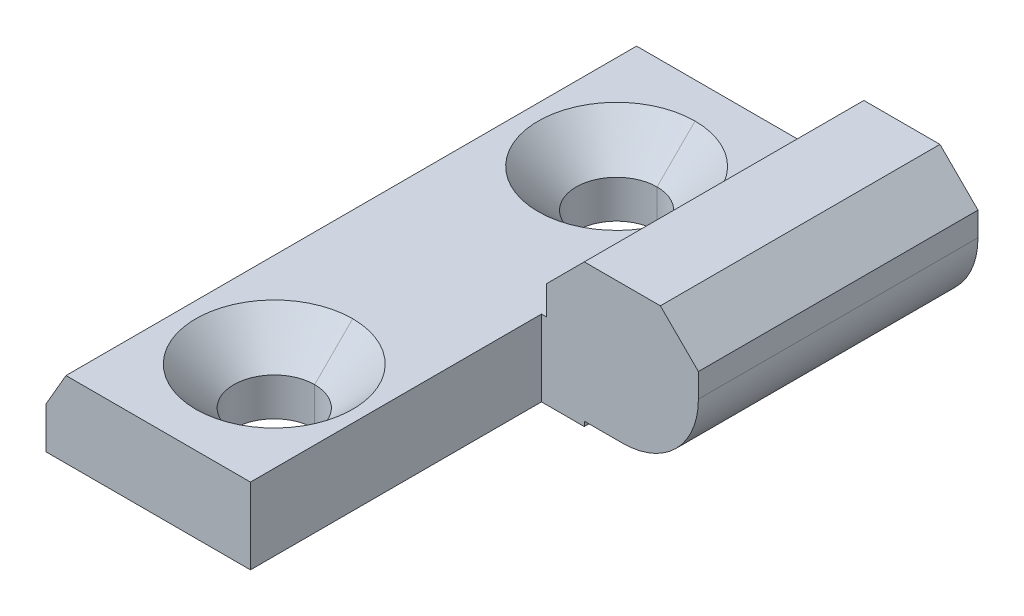
ISO-10303-21;
HEADER;
FILE_DESCRIPTION(('STEP AP214'),'2;1');
FILE_NAME('part.step','',(''),(''),'','','');
FILE_SCHEMA(('AUTOMOTIVE_DESIGN { 1 0 10303 214 1 1 1 1 }'));
ENDSEC;
DATA;
#1=APPLICATION_CONTEXT('core data for automotive mechanical design processes');
#2=APPLICATION_PROTOCOL_DEFINITION('international standard','automotive_design',2000,#1);
#3=PRODUCT_CONTEXT('',#1,'mechanical');
#4=PRODUCT('Part','Part','',(#3));
#5=PRODUCT_RELATED_PRODUCT_CATEGORY('part','',(#4));
#6=PRODUCT_DEFINITION_FORMATION('','',#4);
#7=PRODUCT_DEFINITION_CONTEXT('part definition',#1,'design');
#8=PRODUCT_DEFINITION('design','',#6,#7);
#9=PRODUCT_DEFINITION_SHAPE('','',#8);
#10=(LENGTH_UNIT() NAMED_UNIT(*) SI_UNIT(.MILLI.,.METRE.));
#11=(NAMED_UNIT(*) PLANE_ANGLE_UNIT() SI_UNIT($,.RADIAN.));
#12=(NAMED_UNIT(*) SI_UNIT($,.STERADIAN.) SOLID_ANGLE_UNIT());
#13=UNCERTAINTY_MEASURE_WITH_UNIT(LENGTH_MEASURE(1.E-05),#10,'distance_accuracy_value','');
#14=(GEOMETRIC_REPRESENTATION_CONTEXT(3) GLOBAL_UNCERTAINTY_ASSIGNED_CONTEXT((#13)) GLOBAL_UNIT_ASSIGNED_CONTEXT((#10,
#11,#12)) REPRESENTATION_CONTEXT('',''));
#15=CARTESIAN_POINT('',(0.,0.,0.));
#16=DIRECTION('',(0.,0.,1.));
#17=DIRECTION('',(1.,0.,0.));
#18=AXIS2_PLACEMENT_3D('',#15,#16,#17);
#19=CARTESIAN_POINT('',(0.,0.,60.));
#20=DIRECTION('',(0.,1.,0.));
#21=DIRECTION('',(0.,0.,1.));
#22=AXIS2_PLACEMENT_3D('',#19,#20,#21);
#23=PLANE('',#22);
#24=CARTESIAN_POINT('',(12.,0.,12.));
#25=DIRECTION('',(0.,-1.,0.));
#26=DIRECTION('',(0.,0.,-1.));
#27=AXIS2_PLACEMENT_3D('',#24,#25,#26);
#28=CIRCLE('',#27,4.25);
#29=CARTESIAN_POINT('',(12.,0.,16.25));
#30=VERTEX_POINT('',#29);
#31=CARTESIAN_POINT('',(12.,0.,7.75));
#32=VERTEX_POINT('',#31);
#33=EDGE_CURVE('E11',#30,#32,#28,.T.);
#34=ORIENTED_EDGE('',*,*,#33,.F.);
#35=CARTESIAN_POINT('',(12.,0.,12.));
#36=DIRECTION('',(0.,-1.,0.));
#37=DIRECTION('',(0.,0.,-1.));
#38=AXIS2_PLACEMENT_3D('',#35,#36,#37);
#39=CIRCLE('',#38,4.25);
#40=EDGE_CURVE('E26',#32,#30,#39,.T.);
#41=ORIENTED_EDGE('',*,*,#40,.F.);
#42=EDGE_LOOP('',(#34,#41));
#43=FACE_BOUND('',#42,.T.);
#44=CARTESIAN_POINT('',(12.,0.,48.));
#45=DIRECTION('',(0.,-1.,0.));
#46=DIRECTION('',(0.,0.,-1.));
#47=AXIS2_PLACEMENT_3D('',#44,#45,#46);
#48=CIRCLE('',#47,4.25);
#49=CARTESIAN_POINT('',(12.,0.,52.25));
#50=VERTEX_POINT('',#49);
#51=CARTESIAN_POINT('',(12.,0.,43.75));
#52=VERTEX_POINT('',#51);
#53=EDGE_CURVE('E507',#50,#52,#48,.T.);
#54=ORIENTED_EDGE('',*,*,#53,.F.);
#55=CARTESIAN_POINT('',(12.,0.,48.));
#56=DIRECTION('',(0.,-1.,0.));
#57=DIRECTION('',(0.,0.,-1.));
#58=AXIS2_PLACEMENT_3D('',#55,#56,#57);
#59=CIRCLE('',#58,4.25);
#60=EDGE_CURVE('E501',#52,#50,#59,.T.);
#61=ORIENTED_EDGE('',*,*,#60,.F.);
#62=EDGE_LOOP('',(#54,#61));
#63=FACE_BOUND('',#62,.T.);
#64=DIRECTION('',(0.,0.,-1.));
#65=VECTOR('',#64,1.);
#66=CARTESIAN_POINT('',(21.5,0.,60.));
#67=LINE('',#66,#65);
#68=CARTESIAN_POINT('',(21.5,0.,60.));
#69=VERTEX_POINT('',#68);
#70=CARTESIAN_POINT('',(21.5,0.,29.4));
#71=VERTEX_POINT('',#70);
#72=EDGE_CURVE('E495',#69,#71,#67,.T.);
#73=ORIENTED_EDGE('',*,*,#72,.F.);
#74=DIRECTION('',(1.,0.,0.));
#75=VECTOR('',#74,1.);
#76=CARTESIAN_POINT('',(0.,0.,60.));
#77=LINE('',#76,#75);
#78=CARTESIAN_POINT('',(0.,0.,60.));
#79=VERTEX_POINT('',#78);
#80=EDGE_CURVE('E489',#79,#69,#77,.T.);
#81=ORIENTED_EDGE('',*,*,#80,.F.);
#82=DIRECTION('',(0.,0.,-1.));
#83=VECTOR('',#82,1.);
#84=CARTESIAN_POINT('',(0.,0.,60.));
#85=LINE('',#84,#83);
#86=CARTESIAN_POINT('',(0.,0.,0.));
#87=VERTEX_POINT('',#86);
#88=EDGE_CURVE('E485',#79,#87,#85,.T.);
#89=ORIENTED_EDGE('',*,*,#88,.T.);
#90=DIRECTION('',(1.,0.,0.));
#91=VECTOR('',#90,1.);
#92=CARTESIAN_POINT('',(0.,0.,0.));
#93=LINE('',#92,#91);
#94=CARTESIAN_POINT('',(26.,0.,0.));
#95=VERTEX_POINT('',#94);
#96=EDGE_CURVE('E480',#87,#95,#93,.T.);
#97=ORIENTED_EDGE('',*,*,#96,.T.);
#98=DIRECTION('',(0.,0.,-1.));
#99=VECTOR('',#98,1.);
#100=CARTESIAN_POINT('',(26.,0.,60.));
#101=LINE('',#100,#99);
#102=CARTESIAN_POINT('',(26.,0.,29.4));
#103=VERTEX_POINT('',#102);
#104=EDGE_CURVE('E474',#103,#95,#101,.T.);
#105=ORIENTED_EDGE('',*,*,#104,.F.);
#106=DIRECTION('',(1.,0.,0.));
#107=VECTOR('',#106,1.);
#108=CARTESIAN_POINT('',(21.5,0.,29.4));
#109=LINE('',#108,#107);
#110=EDGE_CURVE('E468',#71,#103,#109,.T.);
#111=ORIENTED_EDGE('',*,*,#110,.F.);
#112=EDGE_LOOP('',(#73,#81,#89,#97,#105,#111));
#113=FACE_BOUND('',#112,.T.);
#114=ADVANCED_FACE('F17',(#43,#63,#113),#23,.F.);
#115=CARTESIAN_POINT('',(0.,0.,29.4));
#116=DIRECTION('',(0.,0.,1.));
#117=DIRECTION('',(1.,0.,0.));
#118=AXIS2_PLACEMENT_3D('',#115,#116,#117);
#119=PLANE('',#118);
#120=DIRECTION('',(0.,1.,0.));
#121=VECTOR('',#120,1.);
#122=CARTESIAN_POINT('',(26.,0.,29.4));
#123=LINE('',#122,#121);
#124=CARTESIAN_POINT('',(26.,0.5,29.4));
#125=VERTEX_POINT('',#124);
#126=EDGE_CURVE('E463',#103,#125,#123,.T.);
#127=ORIENTED_EDGE('',*,*,#126,.T.);
#128=DIRECTION('',(1.,0.,0.));
#129=VECTOR('',#128,1.);
#130=CARTESIAN_POINT('',(26.,0.5,29.4));
#131=LINE('',#130,#129);
#132=CARTESIAN_POINT('',(30.,0.5,29.4));
#133=VERTEX_POINT('',#132);
#134=EDGE_CURVE('E458',#125,#133,#131,.T.);
#135=ORIENTED_EDGE('',*,*,#134,.T.);
#136=CARTESIAN_POINT('',(29.9999999999994,8.50000000000062,29.4));
#137=DIRECTION('',(0.,0.,1.));
#138=DIRECTION('',(1.,0.,0.));
#139=AXIS2_PLACEMENT_3D('',#136,#137,#138);
#140=CIRCLE('',#139,8.00000000000062);
#141=CARTESIAN_POINT('',(38.,8.5,29.4));
#142=VERTEX_POINT('',#141);
#143=EDGE_CURVE('E453',#133,#142,#140,.T.);
#144=ORIENTED_EDGE('',*,*,#143,.T.);
#145=DIRECTION('',(0.,1.,0.));
#146=VECTOR('',#145,1.);
#147=CARTESIAN_POINT('',(38.,0.,29.4));
#148=LINE('',#147,#146);
#149=CARTESIAN_POINT('',(38.,11.015640288664,29.4));
#150=VERTEX_POINT('',#149);
#151=EDGE_CURVE('E448',#142,#150,#148,.T.);
#152=ORIENTED_EDGE('',*,*,#151,.T.);
#153=DIRECTION('',(-0.708490549139333,0.705720299963269,0.));
#154=VECTOR('',#153,1.);
#155=CARTESIAN_POINT('',(38.,11.015640288664,29.4));
#156=LINE('',#155,#154);
#157=CARTESIAN_POINT('',(34.,15.,29.4));
#158=VERTEX_POINT('',#157);
#159=EDGE_CURVE('E443',#150,#158,#156,.T.);
#160=ORIENTED_EDGE('',*,*,#159,.T.);
#161=DIRECTION('',(-1.,0.,0.));
#162=VECTOR('',#161,1.);
#163=CARTESIAN_POINT('',(38.,15.,29.4));
#164=LINE('',#163,#162);
#165=CARTESIAN_POINT('',(26.,15.,29.4));
#166=VERTEX_POINT('',#165);
#167=EDGE_CURVE('E438',#158,#166,#164,.T.);
#168=ORIENTED_EDGE('',*,*,#167,.T.);
#169=DIRECTION('',(-0.707106781186548,-0.707106781186547,0.));
#170=VECTOR('',#169,1.);
#171=CARTESIAN_POINT('',(26.,15.,29.4));
#172=LINE('',#171,#170);
#173=CARTESIAN_POINT('',(22.015640288664,11.015640288664,29.4));
#174=VERTEX_POINT('',#173);
#175=EDGE_CURVE('E433',#166,#174,#172,.T.);
#176=ORIENTED_EDGE('',*,*,#175,.T.);
#177=DIRECTION('',(0.,-1.,0.));
#178=VECTOR('',#177,1.);
#179=CARTESIAN_POINT('',(22.015640288664,11.015640288664,29.4));
#180=LINE('',#179,#178);
#181=CARTESIAN_POINT('',(22.015640288664,8.,29.4));
#182=VERTEX_POINT('',#181);
#183=EDGE_CURVE('E428',#174,#182,#180,.T.);
#184=ORIENTED_EDGE('',*,*,#183,.T.);
#185=DIRECTION('',(-1.,0.,0.));
#186=VECTOR('',#185,1.);
#187=CARTESIAN_POINT('',(22.015640288664,8.,29.4));
#188=LINE('',#187,#186);
#189=CARTESIAN_POINT('',(21.5,8.,29.4));
#190=VERTEX_POINT('',#189);
#191=EDGE_CURVE('E423',#182,#190,#188,.T.);
#192=ORIENTED_EDGE('',*,*,#191,.T.);
#193=DIRECTION('',(0.,-1.,0.));
#194=VECTOR('',#193,1.);
#195=CARTESIAN_POINT('',(21.5,15.,29.4));
#196=LINE('',#195,#194);
#197=EDGE_CURVE('E417',#190,#71,#196,.T.);
#198=ORIENTED_EDGE('',*,*,#197,.T.);
#199=ORIENTED_EDGE('',*,*,#110,.T.);
#200=EDGE_LOOP('',(#127,#135,#144,#152,#160,#168,#176,#184,#192,#198,#199));
#201=FACE_BOUND('',#200,.T.);
#202=ADVANCED_FACE('F565',(#201),#119,.T.);
#203=CARTESIAN_POINT('',(21.5,15.,60.));
#204=DIRECTION('',(1.,0.,0.));
#205=DIRECTION('',(0.,0.,-1.));
#206=AXIS2_PLACEMENT_3D('',#203,#204,#205);
#207=PLANE('',#206);
#208=DIRECTION('',(0.,0.,1.));
#209=VECTOR('',#208,1.);
#210=CARTESIAN_POINT('',(21.5,8.,60.));
#211=LINE('',#210,#209);
#212=CARTESIAN_POINT('',(21.5,8.,60.));
#213=VERTEX_POINT('',#212);
#214=EDGE_CURVE('E412',#190,#213,#211,.T.);
#215=ORIENTED_EDGE('',*,*,#214,.T.);
#216=DIRECTION('',(0.,1.,0.));
#217=VECTOR('',#216,1.);
#218=CARTESIAN_POINT('',(21.5,8.50000000000062,60.));
#219=LINE('',#218,#217);
#220=EDGE_CURVE('E406',#69,#213,#219,.T.);
#221=ORIENTED_EDGE('',*,*,#220,.F.);
#222=ORIENTED_EDGE('',*,*,#72,.T.);
#223=ORIENTED_EDGE('',*,*,#197,.F.);
#224=EDGE_LOOP('',(#215,#221,#222,#223));
#225=FACE_BOUND('',#224,.T.);
#226=ADVANCED_FACE('F563',(#225),#207,.T.);
#227=CARTESIAN_POINT('',(29.9999999999994,8.50000000000062,60.));
#228=DIRECTION('',(0.,0.,1.));
#229=DIRECTION('',(1.,0.,0.));
#230=AXIS2_PLACEMENT_3D('',#227,#228,#229);
#231=PLANE('',#230);
#232=ORIENTED_EDGE('',*,*,#80,.T.);
#233=ORIENTED_EDGE('',*,*,#220,.T.);
#234=DIRECTION('',(-1.,0.,0.));
#235=VECTOR('',#234,1.);
#236=CARTESIAN_POINT('',(22.015640288664,8.,60.));
#237=LINE('',#236,#235);
#238=CARTESIAN_POINT('',(2.1,8.,60.));
#239=VERTEX_POINT('',#238);
#240=EDGE_CURVE('E401',#213,#239,#237,.T.);
#241=ORIENTED_EDGE('',*,*,#240,.T.);
#242=DIRECTION('',(-0.500000000000001,-0.866025403784438,0.));
#243=VECTOR('',#242,1.);
#244=CARTESIAN_POINT('',(2.1,8.,60.));
#245=LINE('',#244,#243);
#246=CARTESIAN_POINT('',(0.,4.3626933041054,60.));
#247=VERTEX_POINT('',#246);
#248=EDGE_CURVE('E397',#239,#247,#245,.T.);
#249=ORIENTED_EDGE('',*,*,#248,.T.);
#250=DIRECTION('',(0.,-1.,0.));
#251=VECTOR('',#250,1.);
#252=CARTESIAN_POINT('',(0.,4.3626933041054,60.));
#253=LINE('',#252,#251);
#254=EDGE_CURVE('E392',#247,#79,#253,.T.);
#255=ORIENTED_EDGE('',*,*,#254,.T.);
#256=EDGE_LOOP('',(#232,#233,#241,#249,#255));
#257=FACE_BOUND('',#256,.T.);
#258=ADVANCED_FACE('F581',(#257),#231,.T.);
#259=CARTESIAN_POINT('',(0.,4.3626933041054,60.));
#260=DIRECTION('',(1.,0.,0.));
#261=DIRECTION('',(0.,0.,-1.));
#262=AXIS2_PLACEMENT_3D('',#259,#260,#261);
#263=PLANE('',#262);
#264=DIRECTION('',(0.,-1.,0.));
#265=VECTOR('',#264,1.);
#266=CARTESIAN_POINT('',(0.,4.3626933041054,0.));
#267=LINE('',#266,#265);
#268=CARTESIAN_POINT('',(0.,4.3626933041054,0.));
#269=VERTEX_POINT('',#268);
#270=EDGE_CURVE('E387',#269,#87,#267,.T.);
#271=ORIENTED_EDGE('',*,*,#270,.T.);
#272=ORIENTED_EDGE('',*,*,#88,.F.);
#273=ORIENTED_EDGE('',*,*,#254,.F.);
#274=DIRECTION('',(0.,0.,-1.));
#275=VECTOR('',#274,1.);
#276=CARTESIAN_POINT('',(0.,4.3626933041054,60.));
#277=LINE('',#276,#275);
#278=EDGE_CURVE('E383',#247,#269,#277,.T.);
#279=ORIENTED_EDGE('',*,*,#278,.T.);
#280=EDGE_LOOP('',(#271,#272,#273,#279));
#281=FACE_BOUND('',#280,.T.);
#282=ADVANCED_FACE('F630',(#281),#263,.F.);
#283=CARTESIAN_POINT('',(2.1,8.,60.));
#284=DIRECTION('',(0.866025403784438,-0.500000000000001,0.));
#285=DIRECTION('',(0.500000000000001,0.866025403784438,0.));
#286=AXIS2_PLACEMENT_3D('',#283,#284,#285);
#287=PLANE('',#286);
#288=DIRECTION('',(-0.500000000000001,-0.866025403784438,0.));
#289=VECTOR('',#288,1.);
#290=CARTESIAN_POINT('',(2.1,8.,0.));
#291=LINE('',#290,#289);
#292=CARTESIAN_POINT('',(2.1,8.,0.));
#293=VERTEX_POINT('',#292);
#294=EDGE_CURVE('E378',#293,#269,#291,.T.);
#295=ORIENTED_EDGE('',*,*,#294,.T.);
#296=ORIENTED_EDGE('',*,*,#278,.F.);
#297=ORIENTED_EDGE('',*,*,#248,.F.);
#298=DIRECTION('',(0.,0.,-1.));
#299=VECTOR('',#298,1.);
#300=CARTESIAN_POINT('',(2.1,8.,60.));
#301=LINE('',#300,#299);
#302=EDGE_CURVE('E374',#239,#293,#301,.T.);
#303=ORIENTED_EDGE('',*,*,#302,.T.);
#304=EDGE_LOOP('',(#295,#296,#297,#303));
#305=FACE_BOUND('',#304,.T.);
#306=ADVANCED_FACE('F552',(#305),#287,.F.);
#307=CARTESIAN_POINT('',(22.015640288664,8.,60.));
#308=DIRECTION('',(0.,-1.,0.));
#309=DIRECTION('',(0.,0.,-1.));
#310=AXIS2_PLACEMENT_3D('',#307,#308,#309);
#311=PLANE('',#310);
#312=CARTESIAN_POINT('',(12.,8.,12.));
#313=DIRECTION('',(0.,-1.,0.));
#314=DIRECTION('',(0.,0.,-1.));
#315=AXIS2_PLACEMENT_3D('',#312,#313,#314);
#316=CIRCLE('',#315,8.25);
#317=CARTESIAN_POINT('',(12.,8.,3.75));
#318=VERTEX_POINT('',#317);
#319=CARTESIAN_POINT('',(12.,8.,20.25));
#320=VERTEX_POINT('',#319);
#321=EDGE_CURVE('E210',#318,#320,#316,.T.);
#322=ORIENTED_EDGE('',*,*,#321,.T.);
#323=CARTESIAN_POINT('',(12.,8.,12.));
#324=DIRECTION('',(0.,-1.,0.));
#325=DIRECTION('',(0.,0.,-1.));
#326=AXIS2_PLACEMENT_3D('',#323,#324,#325);
#327=CIRCLE('',#326,8.25);
#328=EDGE_CURVE('E365',#320,#318,#327,.T.);
#329=ORIENTED_EDGE('',*,*,#328,.T.);
#330=EDGE_LOOP('',(#322,#329));
#331=FACE_BOUND('',#330,.T.);
#332=CARTESIAN_POINT('',(12.,8.,48.));
#333=DIRECTION('',(0.,-1.,0.));
#334=DIRECTION('',(0.,0.,-1.));
#335=AXIS2_PLACEMENT_3D('',#332,#333,#334);
#336=CIRCLE('',#335,8.25);
#337=CARTESIAN_POINT('',(12.,8.,39.75));
#338=VERTEX_POINT('',#337);
#339=CARTESIAN_POINT('',(12.,8.,56.25));
#340=VERTEX_POINT('',#339);
#341=EDGE_CURVE('E360',#338,#340,#336,.T.);
#342=ORIENTED_EDGE('',*,*,#341,.T.);
#343=CARTESIAN_POINT('',(12.,8.,48.));
#344=DIRECTION('',(0.,-1.,0.));
#345=DIRECTION('',(0.,0.,-1.));
#346=AXIS2_PLACEMENT_3D('',#343,#344,#345);
#347=CIRCLE('',#346,8.25);
#348=EDGE_CURVE('E355',#340,#338,#347,.T.);
#349=ORIENTED_EDGE('',*,*,#348,.T.);
#350=EDGE_LOOP('',(#342,#349));
#351=FACE_BOUND('',#350,.T.);
#352=ORIENTED_EDGE('',*,*,#214,.F.);
#353=ORIENTED_EDGE('',*,*,#191,.F.);
#354=DIRECTION('',(0.,0.,-1.));
#355=VECTOR('',#354,1.);
#356=CARTESIAN_POINT('',(22.015640288664,8.,60.));
#357=LINE('',#356,#355);
#358=CARTESIAN_POINT('',(22.015640288664,8.,0.));
#359=VERTEX_POINT('',#358);
#360=EDGE_CURVE('E350',#182,#359,#357,.T.);
#361=ORIENTED_EDGE('',*,*,#360,.T.);
#362=DIRECTION('',(-1.,0.,0.));
#363=VECTOR('',#362,1.);
#364=CARTESIAN_POINT('',(22.015640288664,8.,0.));
#365=LINE('',#364,#363);
#366=EDGE_CURVE('E344',#359,#293,#365,.T.);
#367=ORIENTED_EDGE('',*,*,#366,.T.);
#368=ORIENTED_EDGE('',*,*,#302,.F.);
#369=ORIENTED_EDGE('',*,*,#240,.F.);
#370=EDGE_LOOP('',(#352,#353,#361,#367,#368,#369));
#371=FACE_BOUND('',#370,.T.);
#372=ADVANCED_FACE('F548',(#331,#351,#371),#311,.F.);
#373=CARTESIAN_POINT('',(29.9999999999994,8.50000000000062,0.));
#374=DIRECTION('',(0.,0.,1.));
#375=DIRECTION('',(1.,0.,0.));
#376=AXIS2_PLACEMENT_3D('',#373,#374,#375);
#377=PLANE('',#376);
#378=ORIENTED_EDGE('',*,*,#294,.F.);
#379=ORIENTED_EDGE('',*,*,#366,.F.);
#380=DIRECTION('',(0.,-1.,0.));
#381=VECTOR('',#380,1.);
#382=CARTESIAN_POINT('',(22.015640288664,11.015640288664,0.));
#383=LINE('',#382,#381);
#384=CARTESIAN_POINT('',(22.015640288664,11.015640288664,0.));
#385=VERTEX_POINT('',#384);
#386=EDGE_CURVE('E338',#385,#359,#383,.T.);
#387=ORIENTED_EDGE('',*,*,#386,.F.);
#388=DIRECTION('',(-0.707106781186548,-0.707106781186547,0.));
#389=VECTOR('',#388,1.);
#390=CARTESIAN_POINT('',(26.,15.,0.));
#391=LINE('',#390,#389);
#392=CARTESIAN_POINT('',(26.,15.,0.));
#393=VERTEX_POINT('',#392);
#394=EDGE_CURVE('E332',#393,#385,#391,.T.);
#395=ORIENTED_EDGE('',*,*,#394,.F.);
#396=DIRECTION('',(-1.,0.,0.));
#397=VECTOR('',#396,1.);
#398=CARTESIAN_POINT('',(34.,15.,0.));
#399=LINE('',#398,#397);
#400=CARTESIAN_POINT('',(34.,15.,0.));
#401=VERTEX_POINT('',#400);
#402=EDGE_CURVE('E326',#401,#393,#399,.T.);
#403=ORIENTED_EDGE('',*,*,#402,.F.);
#404=DIRECTION('',(-0.708490549139333,0.705720299963269,0.));
#405=VECTOR('',#404,1.);
#406=CARTESIAN_POINT('',(38.,11.015640288664,0.));
#407=LINE('',#406,#405);
#408=CARTESIAN_POINT('',(38.,11.015640288664,0.));
#409=VERTEX_POINT('',#408);
#410=EDGE_CURVE('E320',#409,#401,#407,.T.);
#411=ORIENTED_EDGE('',*,*,#410,.F.);
#412=DIRECTION('',(0.,1.,0.));
#413=VECTOR('',#412,1.);
#414=CARTESIAN_POINT('',(38.,8.5,0.));
#415=LINE('',#414,#413);
#416=CARTESIAN_POINT('',(38.,8.5,0.));
#417=VERTEX_POINT('',#416);
#418=EDGE_CURVE('E314',#417,#409,#415,.T.);
#419=ORIENTED_EDGE('',*,*,#418,.F.);
#420=CARTESIAN_POINT('',(29.9999999999994,8.50000000000062,0.));
#421=DIRECTION('',(0.,0.,1.));
#422=DIRECTION('',(1.,0.,0.));
#423=AXIS2_PLACEMENT_3D('',#420,#421,#422);
#424=CIRCLE('',#423,8.00000000000062);
#425=CARTESIAN_POINT('',(30.,0.5,0.));
#426=VERTEX_POINT('',#425);
#427=EDGE_CURVE('E309',#426,#417,#424,.T.);
#428=ORIENTED_EDGE('',*,*,#427,.F.);
#429=DIRECTION('',(1.,0.,0.));
#430=VECTOR('',#429,1.);
#431=CARTESIAN_POINT('',(26.,0.5,0.));
#432=LINE('',#431,#430);
#433=CARTESIAN_POINT('',(26.,0.5,0.));
#434=VERTEX_POINT('',#433);
#435=EDGE_CURVE('E303',#434,#426,#432,.T.);
#436=ORIENTED_EDGE('',*,*,#435,.F.);
#437=DIRECTION('',(0.,1.,0.));
#438=VECTOR('',#437,1.);
#439=CARTESIAN_POINT('',(26.,0.,0.));
#440=LINE('',#439,#438);
#441=EDGE_CURVE('E297',#95,#434,#440,.T.);
#442=ORIENTED_EDGE('',*,*,#441,.F.);
#443=ORIENTED_EDGE('',*,*,#96,.F.);
#444=ORIENTED_EDGE('',*,*,#270,.F.);
#445=EDGE_LOOP('',(#378,#379,#387,#395,#403,#411,#419,#428,#436,#442,#443,#444));
#446=FACE_BOUND('',#445,.T.);
#447=ADVANCED_FACE('F551',(#446),#377,.F.);
#448=CARTESIAN_POINT('',(26.,0.,60.));
#449=DIRECTION('',(-1.,0.,0.));
#450=DIRECTION('',(0.,0.,1.));
#451=AXIS2_PLACEMENT_3D('',#448,#449,#450);
#452=PLANE('',#451);
#453=ORIENTED_EDGE('',*,*,#126,.F.);
#454=ORIENTED_EDGE('',*,*,#104,.T.);
#455=ORIENTED_EDGE('',*,*,#441,.T.);
#456=DIRECTION('',(0.,0.,-1.));
#457=VECTOR('',#456,1.);
#458=CARTESIAN_POINT('',(26.,0.5,60.));
#459=LINE('',#458,#457);
#460=EDGE_CURVE('E291',#125,#434,#459,.T.);
#461=ORIENTED_EDGE('',*,*,#460,.F.);
#462=EDGE_LOOP('',(#453,#454,#455,#461));
#463=FACE_BOUND('',#462,.T.);
#464=ADVANCED_FACE('F587',(#463),#452,.F.);
#465=CARTESIAN_POINT('',(26.,0.5,60.));
#466=DIRECTION('',(0.,1.,0.));
#467=DIRECTION('',(0.,0.,1.));
#468=AXIS2_PLACEMENT_3D('',#465,#466,#467);
#469=PLANE('',#468);
#470=ORIENTED_EDGE('',*,*,#134,.F.);
#471=ORIENTED_EDGE('',*,*,#460,.T.);
#472=ORIENTED_EDGE('',*,*,#435,.T.);
#473=DIRECTION('',(0.,0.,-1.));
#474=VECTOR('',#473,1.);
#475=CARTESIAN_POINT('',(30.,0.5,60.));
#476=LINE('',#475,#474);
#477=EDGE_CURVE('E285',#133,#426,#476,.T.);
#478=ORIENTED_EDGE('',*,*,#477,.F.);
#479=EDGE_LOOP('',(#470,#471,#472,#478));
#480=FACE_BOUND('',#479,.T.);
#481=ADVANCED_FACE('F593',(#480),#469,.F.);
#482=CARTESIAN_POINT('',(29.9999999999994,8.50000000000062,60.));
#483=DIRECTION('',(0.,0.,-1.));
#484=DIRECTION('',(-0.707106781186574,0.707106781186521,0.));
#485=AXIS2_PLACEMENT_3D('',#482,#483,#484);
#486=CYLINDRICAL_SURFACE('',#485,8.00000000000062);
#487=ORIENTED_EDGE('',*,*,#143,.F.);
#488=ORIENTED_EDGE('',*,*,#477,.T.);
#489=ORIENTED_EDGE('',*,*,#427,.T.);
#490=DIRECTION('',(0.,0.,-1.));
#491=VECTOR('',#490,1.);
#492=CARTESIAN_POINT('',(38.,8.5,60.));
#493=LINE('',#492,#491);
#494=EDGE_CURVE('E279',#142,#417,#493,.T.);
#495=ORIENTED_EDGE('',*,*,#494,.F.);
#496=EDGE_LOOP('',(#487,#488,#489,#495));
#497=FACE_BOUND('',#496,.T.);
#498=ADVANCED_FACE('F595',(#497),#486,.T.);
#499=CARTESIAN_POINT('',(38.,8.5,60.));
#500=DIRECTION('',(-1.,0.,0.));
#501=DIRECTION('',(0.,0.,1.));
#502=AXIS2_PLACEMENT_3D('',#499,#500,#501);
#503=PLANE('',#502);
#504=ORIENTED_EDGE('',*,*,#151,.F.);
#505=ORIENTED_EDGE('',*,*,#494,.T.);
#506=ORIENTED_EDGE('',*,*,#418,.T.);
#507=DIRECTION('',(0.,0.,-1.));
#508=VECTOR('',#507,1.);
#509=CARTESIAN_POINT('',(38.,11.015640288664,60.));
#510=LINE('',#509,#508);
#511=EDGE_CURVE('E273',#150,#409,#510,.T.);
#512=ORIENTED_EDGE('',*,*,#511,.F.);
#513=EDGE_LOOP('',(#504,#505,#506,#512));
#514=FACE_BOUND('',#513,.T.);
#515=ADVANCED_FACE('F599',(#514),#503,.F.);
#516=CARTESIAN_POINT('',(38.,11.015640288664,60.));
#517=DIRECTION('',(-0.705720299963269,-0.708490549139333,0.));
#518=DIRECTION('',(0.708490549139333,-0.705720299963269,0.));
#519=AXIS2_PLACEMENT_3D('',#516,#517,#518);
#520=PLANE('',#519);
#521=ORIENTED_EDGE('',*,*,#159,.F.);
#522=ORIENTED_EDGE('',*,*,#511,.T.);
#523=ORIENTED_EDGE('',*,*,#410,.T.);
#524=DIRECTION('',(0.,0.,-1.));
#525=VECTOR('',#524,1.);
#526=CARTESIAN_POINT('',(34.,15.,60.));
#527=LINE('',#526,#525);
#528=EDGE_CURVE('E267',#158,#401,#527,.T.);
#529=ORIENTED_EDGE('',*,*,#528,.F.);
#530=EDGE_LOOP('',(#521,#522,#523,#529));
#531=FACE_BOUND('',#530,.T.);
#532=ADVANCED_FACE('F605',(#531),#520,.F.);
#533=CARTESIAN_POINT('',(34.,15.,60.));
#534=DIRECTION('',(0.,-1.,0.));
#535=DIRECTION('',(0.,0.,-1.));
#536=AXIS2_PLACEMENT_3D('',#533,#534,#535);
#537=PLANE('',#536);
#538=ORIENTED_EDGE('',*,*,#167,.F.);
#539=ORIENTED_EDGE('',*,*,#528,.T.);
#540=ORIENTED_EDGE('',*,*,#402,.T.);
#541=DIRECTION('',(0.,0.,-1.));
#542=VECTOR('',#541,1.);
#543=CARTESIAN_POINT('',(26.,15.,60.));
#544=LINE('',#543,#542);
#545=EDGE_CURVE('E261',#166,#393,#544,.T.);
#546=ORIENTED_EDGE('',*,*,#545,.F.);
#547=EDGE_LOOP('',(#538,#539,#540,#546));
#548=FACE_BOUND('',#547,.T.);
#549=ADVANCED_FACE('F607',(#548),#537,.F.);
#550=CARTESIAN_POINT('',(26.,15.,60.));
#551=DIRECTION('',(0.707106781186547,-0.707106781186548,0.));
#552=DIRECTION('',(0.707106781186548,0.707106781186547,0.));
#553=AXIS2_PLACEMENT_3D('',#550,#551,#552);
#554=PLANE('',#553);
#555=ORIENTED_EDGE('',*,*,#175,.F.);
#556=ORIENTED_EDGE('',*,*,#545,.T.);
#557=ORIENTED_EDGE('',*,*,#394,.T.);
#558=DIRECTION('',(0.,0.,-1.));
#559=VECTOR('',#558,1.);
#560=CARTESIAN_POINT('',(22.015640288664,11.015640288664,60.));
#561=LINE('',#560,#559);
#562=EDGE_CURVE('E255',#174,#385,#561,.T.);
#563=ORIENTED_EDGE('',*,*,#562,.F.);
#564=EDGE_LOOP('',(#555,#556,#557,#563));
#565=FACE_BOUND('',#564,.T.);
#566=ADVANCED_FACE('F609',(#565),#554,.F.);
#567=CARTESIAN_POINT('',(22.015640288664,11.015640288664,60.));
#568=DIRECTION('',(1.,0.,0.));
#569=DIRECTION('',(0.,0.,-1.));
#570=AXIS2_PLACEMENT_3D('',#567,#568,#569);
#571=PLANE('',#570);
#572=ORIENTED_EDGE('',*,*,#183,.F.);
#573=ORIENTED_EDGE('',*,*,#562,.T.);
#574=ORIENTED_EDGE('',*,*,#386,.T.);
#575=ORIENTED_EDGE('',*,*,#360,.F.);
#576=EDGE_LOOP('',(#572,#573,#574,#575));
#577=FACE_BOUND('',#576,.T.);
#578=ADVANCED_FACE('F570',(#577),#571,.F.);
#579=CARTESIAN_POINT('',(12.,8.,48.));
#580=DIRECTION('',(0.,1.,0.));
#581=DIRECTION('',(1.,0.,0.));
#582=AXIS2_PLACEMENT_3D('',#579,#580,#581);
#583=CONICAL_SURFACE('',#582,8.25,0.785398163397448);
#584=DIRECTION('',(0.,0.707106781186547,-0.707106781186548));
#585=VECTOR('',#584,1.);
#586=CARTESIAN_POINT('',(12.,4.,43.75));
#587=LINE('',#586,#585);
#588=CARTESIAN_POINT('',(12.,4.,43.75));
#589=VERTEX_POINT('',#588);
#590=EDGE_CURVE('E249',#589,#338,#587,.T.);
#591=ORIENTED_EDGE('',*,*,#590,.T.);
#592=ORIENTED_EDGE('',*,*,#348,.F.);
#593=DIRECTION('',(0.,0.707106781186547,0.707106781186548));
#594=VECTOR('',#593,1.);
#595=CARTESIAN_POINT('',(12.,4.,52.25));
#596=LINE('',#595,#594);
#597=CARTESIAN_POINT('',(12.,4.,52.25));
#598=VERTEX_POINT('',#597);
#599=EDGE_CURVE('E243',#598,#340,#596,.T.);
#600=ORIENTED_EDGE('',*,*,#599,.F.);
#601=CARTESIAN_POINT('',(12.,4.,48.));
#602=DIRECTION('',(0.,-1.,0.));
#603=DIRECTION('',(0.,0.,-1.));
#604=AXIS2_PLACEMENT_3D('',#601,#602,#603);
#605=CIRCLE('',#604,4.25);
#606=EDGE_CURVE('E238',#598,#589,#605,.T.);
#607=ORIENTED_EDGE('',*,*,#606,.T.);
#608=EDGE_LOOP('',(#591,#592,#600,#607));
#609=FACE_BOUND('',#608,.T.);
#610=ADVANCED_FACE('F546',(#609),#583,.F.);
#611=CARTESIAN_POINT('',(12.,0.,48.));
#612=DIRECTION('',(0.,-1.,0.));
#613=DIRECTION('',(1.,0.,0.));
#614=AXIS2_PLACEMENT_3D('',#611,#612,#613);
#615=CYLINDRICAL_SURFACE('',#614,4.25);
#616=DIRECTION('',(0.,-1.,0.));
#617=VECTOR('',#616,1.);
#618=CARTESIAN_POINT('',(12.,4.,52.25));
#619=LINE('',#618,#617);
#620=EDGE_CURVE('E232',#598,#50,#619,.T.);
#621=ORIENTED_EDGE('',*,*,#620,.T.);
#622=ORIENTED_EDGE('',*,*,#53,.T.);
#623=DIRECTION('',(0.,-1.,0.));
#624=VECTOR('',#623,1.);
#625=CARTESIAN_POINT('',(12.,4.,43.75));
#626=LINE('',#625,#624);
#627=EDGE_CURVE('E218',#589,#52,#626,.T.);
#628=ORIENTED_EDGE('',*,*,#627,.F.);
#629=ORIENTED_EDGE('',*,*,#606,.F.);
#630=EDGE_LOOP('',(#621,#622,#628,#629));
#631=FACE_BOUND('',#630,.T.);
#632=ADVANCED_FACE('F532',(#631),#615,.F.);
#633=CARTESIAN_POINT('',(12.,0.,48.));
#634=DIRECTION('',(0.,-1.,0.));
#635=DIRECTION('',(-1.,0.,0.));
#636=AXIS2_PLACEMENT_3D('',#633,#634,#635);
#637=CYLINDRICAL_SURFACE('',#636,4.25);
#638=ORIENTED_EDGE('',*,*,#620,.F.);
#639=CARTESIAN_POINT('',(12.,4.,48.));
#640=DIRECTION('',(0.,-1.,0.));
#641=DIRECTION('',(0.,0.,-1.));
#642=AXIS2_PLACEMENT_3D('',#639,#640,#641);
#643=CIRCLE('',#642,4.25);
#644=EDGE_CURVE('E212',#589,#598,#643,.T.);
#645=ORIENTED_EDGE('',*,*,#644,.F.);
#646=ORIENTED_EDGE('',*,*,#627,.T.);
#647=ORIENTED_EDGE('',*,*,#60,.T.);
#648=EDGE_LOOP('',(#638,#645,#646,#647));
#649=FACE_BOUND('',#648,.T.);
#650=ADVANCED_FACE('F539',(#649),#637,.F.);
#651=CARTESIAN_POINT('',(12.,8.,48.));
#652=DIRECTION('',(0.,1.,0.));
#653=DIRECTION('',(-1.,0.,0.));
#654=AXIS2_PLACEMENT_3D('',#651,#652,#653);
#655=CONICAL_SURFACE('',#654,8.25,0.785398163397448);
#656=ORIENTED_EDGE('',*,*,#590,.F.);
#657=ORIENTED_EDGE('',*,*,#644,.T.);
#658=ORIENTED_EDGE('',*,*,#599,.T.);
#659=ORIENTED_EDGE('',*,*,#341,.F.);
#660=EDGE_LOOP('',(#656,#657,#658,#659));
#661=FACE_BOUND('',#660,.T.);
#662=ADVANCED_FACE('F543',(#661),#655,.F.);
#663=CARTESIAN_POINT('',(12.,8.,12.));
#664=DIRECTION('',(0.,1.,0.));
#665=DIRECTION('',(1.,0.,0.));
#666=AXIS2_PLACEMENT_3D('',#663,#664,#665);
#667=CONICAL_SURFACE('',#666,8.25,0.785398163397448);
#668=DIRECTION('',(0.,0.707106781186548,-0.707106781186547));
#669=VECTOR('',#668,1.);
#670=CARTESIAN_POINT('',(12.,4.,7.75));
#671=LINE('',#670,#669);
#672=CARTESIAN_POINT('',(12.,4.,7.75));
#673=VERTEX_POINT('',#672);
#674=EDGE_CURVE('E188',#673,#318,#671,.T.);
#675=ORIENTED_EDGE('',*,*,#674,.T.);
#676=ORIENTED_EDGE('',*,*,#328,.F.);
#677=DIRECTION('',(0.,0.707106781186547,0.707106781186548));
#678=VECTOR('',#677,1.);
#679=CARTESIAN_POINT('',(12.,4.,16.25));
#680=LINE('',#679,#678);
#681=CARTESIAN_POINT('',(12.,4.,16.25));
#682=VERTEX_POINT('',#681);
#683=EDGE_CURVE('E191',#682,#320,#680,.T.);
#684=ORIENTED_EDGE('',*,*,#683,.F.);
#685=CARTESIAN_POINT('',(12.,4.,12.));
#686=DIRECTION('',(0.,-1.,0.));
#687=DIRECTION('',(0.,0.,-1.));
#688=AXIS2_PLACEMENT_3D('',#685,#686,#687);
#689=CIRCLE('',#688,4.25);
#690=EDGE_CURVE('E183',#682,#673,#689,.T.);
#691=ORIENTED_EDGE('',*,*,#690,.T.);
#692=EDGE_LOOP('',(#675,#676,#684,#691));
#693=FACE_BOUND('',#692,.T.);
#694=ADVANCED_FACE('F185',(#693),#667,.F.);
#695=CARTESIAN_POINT('',(12.,0.,12.));
#696=DIRECTION('',(0.,-1.,0.));
#697=DIRECTION('',(1.,0.,0.));
#698=AXIS2_PLACEMENT_3D('',#695,#696,#697);
#699=CYLINDRICAL_SURFACE('',#698,4.25);
#700=DIRECTION('',(0.,-1.,0.));
#701=VECTOR('',#700,1.);
#702=CARTESIAN_POINT('',(12.,4.,16.25));
#703=LINE('',#702,#701);
#704=EDGE_CURVE('E195',#682,#30,#703,.T.);
#705=ORIENTED_EDGE('',*,*,#704,.T.);
#706=ORIENTED_EDGE('',*,*,#33,.T.);
#707=DIRECTION('',(0.,-1.,0.));
#708=VECTOR('',#707,1.);
#709=CARTESIAN_POINT('',(12.,4.,7.75));
#710=LINE('',#709,#708);
#711=EDGE_CURVE('E197',#673,#32,#710,.T.);
#712=ORIENTED_EDGE('',*,*,#711,.F.);
#713=ORIENTED_EDGE('',*,*,#690,.F.);
#714=EDGE_LOOP('',(#705,#706,#712,#713));
#715=FACE_BOUND('',#714,.T.);
#716=ADVANCED_FACE('F199',(#715),#699,.F.);
#717=CARTESIAN_POINT('',(12.,0.,12.));
#718=DIRECTION('',(0.,-1.,0.));
#719=DIRECTION('',(-1.,0.,0.));
#720=AXIS2_PLACEMENT_3D('',#717,#718,#719);
#721=CYLINDRICAL_SURFACE('',#720,4.25);
#722=ORIENTED_EDGE('',*,*,#704,.F.);
#723=CARTESIAN_POINT('',(12.,4.,12.));
#724=DIRECTION('',(0.,-1.,0.));
#725=DIRECTION('',(0.,0.,-1.));
#726=AXIS2_PLACEMENT_3D('',#723,#724,#725);
#727=CIRCLE('',#726,4.25);
#728=EDGE_CURVE('E202',#673,#682,#727,.T.);
#729=ORIENTED_EDGE('',*,*,#728,.F.);
#730=ORIENTED_EDGE('',*,*,#711,.T.);
#731=ORIENTED_EDGE('',*,*,#40,.T.);
#732=EDGE_LOOP('',(#722,#729,#730,#731));
#733=FACE_BOUND('',#732,.T.);
#734=ADVANCED_FACE('F205',(#733),#721,.F.);
#735=CARTESIAN_POINT('',(12.,8.,12.));
#736=DIRECTION('',(0.,1.,0.));
#737=DIRECTION('',(-1.,0.,0.));
#738=AXIS2_PLACEMENT_3D('',#735,#736,#737);
#739=CONICAL_SURFACE('',#738,8.25,0.785398163397448);
#740=ORIENTED_EDGE('',*,*,#674,.F.);
#741=ORIENTED_EDGE('',*,*,#728,.T.);
#742=ORIENTED_EDGE('',*,*,#683,.T.);
#743=ORIENTED_EDGE('',*,*,#321,.F.);
#744=EDGE_LOOP('',(#740,#741,#742,#743));
#745=FACE_BOUND('',#744,.T.);
#746=ADVANCED_FACE('F209',(#745),#739,.F.);
#747=CLOSED_SHELL('',(#114,#202,#226,#258,#282,#306,#372,#447,#464,#481,#498,#515,#532,#549,
#566,#578,#610,#632,#650,#662,#694,#716,#734,#746));
#748=MANIFOLD_SOLID_BREP('B1',#747);
#749=ADVANCED_BREP_SHAPE_REPRESENTATION('',(#18,#748),#14);
#750=SHAPE_DEFINITION_REPRESENTATION(#9,#749);
ENDSEC;
END-ISO-10303-21;
